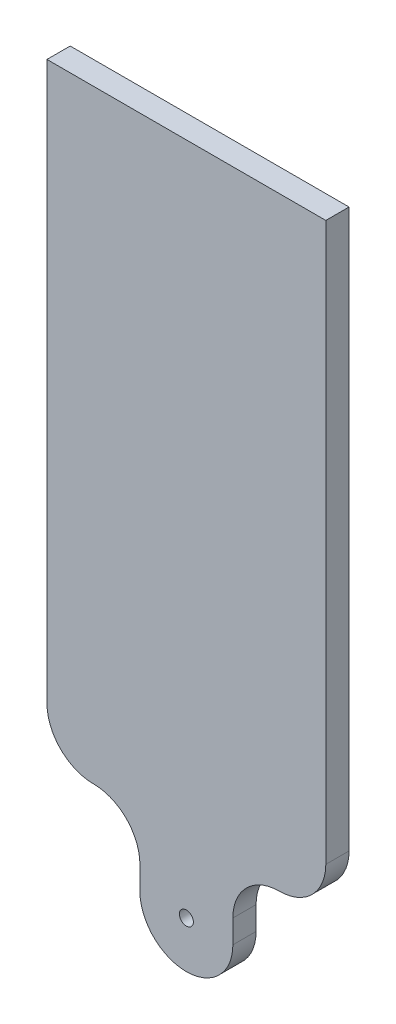
ISO-10303-21;
HEADER;
FILE_DESCRIPTION(('STEP AP214'),'2;1');
FILE_NAME('part.step','',(''),(''),'','','');
FILE_SCHEMA(('AUTOMOTIVE_DESIGN { 1 0 10303 214 1 1 1 1 }'));
ENDSEC;
DATA;
#1=APPLICATION_CONTEXT('core data for automotive mechanical design processes');
#2=APPLICATION_PROTOCOL_DEFINITION('international standard','automotive_design',2000,#1);
#3=PRODUCT_CONTEXT('',#1,'mechanical');
#4=PRODUCT('Part','Part','',(#3));
#5=PRODUCT_RELATED_PRODUCT_CATEGORY('part','',(#4));
#6=PRODUCT_DEFINITION_FORMATION('','',#4);
#7=PRODUCT_DEFINITION_CONTEXT('part definition',#1,'design');
#8=PRODUCT_DEFINITION('design','',#6,#7);
#9=PRODUCT_DEFINITION_SHAPE('','',#8);
#10=(LENGTH_UNIT() NAMED_UNIT(*) SI_UNIT(.MILLI.,.METRE.));
#11=(NAMED_UNIT(*) PLANE_ANGLE_UNIT() SI_UNIT($,.RADIAN.));
#12=(NAMED_UNIT(*) SI_UNIT($,.STERADIAN.) SOLID_ANGLE_UNIT());
#13=UNCERTAINTY_MEASURE_WITH_UNIT(LENGTH_MEASURE(1.E-05),#10,'distance_accuracy_value','');
#14=(GEOMETRIC_REPRESENTATION_CONTEXT(3) GLOBAL_UNCERTAINTY_ASSIGNED_CONTEXT((#13)) GLOBAL_UNIT_ASSIGNED_CONTEXT((#10,
#11,#12)) REPRESENTATION_CONTEXT('',''));
#15=CARTESIAN_POINT('',(0.,0.,0.));
#16=DIRECTION('',(0.,0.,1.));
#17=DIRECTION('',(1.,0.,0.));
#18=AXIS2_PLACEMENT_3D('',#15,#16,#17);
#19=CARTESIAN_POINT('',(-4.08966397750088,13.1353936637728,5.));
#20=DIRECTION('',(0.,0.,-1.));
#21=DIRECTION('',(-1.,0.,0.));
#22=AXIS2_PLACEMENT_3D('',#19,#20,#21);
#23=CYLINDRICAL_SURFACE('',#22,10.);
#24=CARTESIAN_POINT('',(-4.08966397750088,13.1353936637728,0.));
#25=DIRECTION('',(0.,0.,1.));
#26=DIRECTION('',(1.,0.,0.));
#27=AXIS2_PLACEMENT_3D('',#24,#25,#26);
#28=CIRCLE('',#27,10.);
#29=CARTESIAN_POINT('',(-14.0896639775009,13.1353936637728,0.));
#30=VERTEX_POINT('',#29);
#31=CARTESIAN_POINT('',(5.91033602249912,13.1353936637728,0.));
#32=VERTEX_POINT('',#31);
#33=EDGE_CURVE('E130',#30,#32,#28,.T.);
#34=ORIENTED_EDGE('',*,*,#33,.T.);
#35=DIRECTION('',(0.,0.,-1.));
#36=VECTOR('',#35,1.);
#37=CARTESIAN_POINT('',(5.91033602249912,13.1353936637728,5.));
#38=LINE('',#37,#36);
#39=CARTESIAN_POINT('',(5.91033602249912,13.1353936637728,5.));
#40=VERTEX_POINT('',#39);
#41=EDGE_CURVE('E114',#40,#32,#38,.T.);
#42=ORIENTED_EDGE('',*,*,#41,.F.);
#43=CARTESIAN_POINT('',(-4.08966397750088,13.1353936637728,5.));
#44=DIRECTION('',(0.,0.,1.));
#45=DIRECTION('',(1.,0.,0.));
#46=AXIS2_PLACEMENT_3D('',#43,#44,#45);
#47=CIRCLE('',#46,10.);
#48=CARTESIAN_POINT('',(-14.0896639775009,13.1353936637728,5.));
#49=VERTEX_POINT('',#48);
#50=EDGE_CURVE('E119',#49,#40,#47,.T.);
#51=ORIENTED_EDGE('',*,*,#50,.F.);
#52=DIRECTION('',(0.,0.,-1.));
#53=VECTOR('',#52,1.);
#54=CARTESIAN_POINT('',(-14.0896639775009,13.1353936637728,5.));
#55=LINE('',#54,#53);
#56=EDGE_CURVE('E188',#49,#30,#55,.T.);
#57=ORIENTED_EDGE('',*,*,#56,.T.);
#58=EDGE_LOOP('',(#34,#42,#51,#57));
#59=FACE_BOUND('',#58,.T.);
#60=ADVANCED_FACE('F33',(#59),#23,.T.);
#61=CARTESIAN_POINT('',(5.91033602249912,13.1353936637728,5.));
#62=DIRECTION('',(-1.,0.,0.));
#63=DIRECTION('',(0.,0.,1.));
#64=AXIS2_PLACEMENT_3D('',#61,#62,#63);
#65=PLANE('',#64);
#66=DIRECTION('',(0.,1.,0.));
#67=VECTOR('',#66,1.);
#68=CARTESIAN_POINT('',(5.91033602249912,13.1353936637728,0.));
#69=LINE('',#68,#67);
#70=CARTESIAN_POINT('',(5.91033602249912,18.1353936637728,0.));
#71=VERTEX_POINT('',#70);
#72=EDGE_CURVE('E201',#32,#71,#69,.T.);
#73=ORIENTED_EDGE('',*,*,#72,.T.);
#74=DIRECTION('',(0.,0.,-1.));
#75=VECTOR('',#74,1.);
#76=CARTESIAN_POINT('',(5.91033602249912,18.1353936637728,5.));
#77=LINE('',#76,#75);
#78=CARTESIAN_POINT('',(5.91033602249912,18.1353936637728,5.));
#79=VERTEX_POINT('',#78);
#80=EDGE_CURVE('E117',#71,#79,#77,.F.);
#81=ORIENTED_EDGE('',*,*,#80,.T.);
#82=DIRECTION('',(0.,1.,0.));
#83=VECTOR('',#82,1.);
#84=CARTESIAN_POINT('',(5.91033602249912,13.1353936637728,5.));
#85=LINE('',#84,#83);
#86=EDGE_CURVE('E109',#40,#79,#85,.T.);
#87=ORIENTED_EDGE('',*,*,#86,.F.);
#88=ORIENTED_EDGE('',*,*,#41,.T.);
#89=EDGE_LOOP('',(#73,#81,#87,#88));
#90=FACE_BOUND('',#89,.T.);
#91=ADVANCED_FACE('F112',(#90),#65,.F.);
#92=CARTESIAN_POINT('',(25.9103360224991,158.135393663773,5.));
#93=DIRECTION('',(-1.,0.,0.));
#94=DIRECTION('',(0.,-1.,0.));
#95=AXIS2_PLACEMENT_3D('',#92,#93,#94);
#96=PLANE('',#95);
#97=DIRECTION('',(0.,1.,0.));
#98=VECTOR('',#97,1.);
#99=CARTESIAN_POINT('',(25.9103360224991,158.135393663773,5.));
#100=LINE('',#99,#98);
#101=CARTESIAN_POINT('',(25.9103360224991,38.1353936637728,5.));
#102=VERTEX_POINT('',#101);
#103=CARTESIAN_POINT('',(25.9103360224991,158.135393663773,5.));
#104=VERTEX_POINT('',#103);
#105=EDGE_CURVE('E118',#102,#104,#100,.T.);
#106=ORIENTED_EDGE('',*,*,#105,.F.);
#107=DIRECTION('',(0.,0.,-1.));
#108=VECTOR('',#107,1.);
#109=CARTESIAN_POINT('',(25.9103360224991,38.1353936637728,5.));
#110=LINE('',#109,#108);
#111=CARTESIAN_POINT('',(25.9103360224991,38.1353936637728,0.));
#112=VERTEX_POINT('',#111);
#113=EDGE_CURVE('E133',#102,#112,#110,.T.);
#114=ORIENTED_EDGE('',*,*,#113,.T.);
#115=DIRECTION('',(0.,1.,0.));
#116=VECTOR('',#115,1.);
#117=CARTESIAN_POINT('',(25.9103360224991,158.135393663773,0.));
#118=LINE('',#117,#116);
#119=CARTESIAN_POINT('',(25.9103360224991,158.135393663773,0.));
#120=VERTEX_POINT('',#119);
#121=EDGE_CURVE('E199',#112,#120,#118,.T.);
#122=ORIENTED_EDGE('',*,*,#121,.T.);
#123=DIRECTION('',(0.,0.,-1.));
#124=VECTOR('',#123,1.);
#125=CARTESIAN_POINT('',(25.9103360224991,158.135393663773,5.));
#126=LINE('',#125,#124);
#127=EDGE_CURVE('E131',#104,#120,#126,.T.);
#128=ORIENTED_EDGE('',*,*,#127,.F.);
#129=EDGE_LOOP('',(#106,#114,#122,#128));
#130=FACE_BOUND('',#129,.T.);
#131=ADVANCED_FACE('F235',(#130),#96,.F.);
#132=CARTESIAN_POINT('',(-34.0896639775009,158.135393663773,5.));
#133=DIRECTION('',(0.,-1.,0.));
#134=DIRECTION('',(0.,0.,-1.));
#135=AXIS2_PLACEMENT_3D('',#132,#133,#134);
#136=PLANE('',#135);
#137=DIRECTION('',(-1.,0.,0.));
#138=VECTOR('',#137,1.);
#139=CARTESIAN_POINT('',(-34.0896639775009,158.135393663773,0.));
#140=LINE('',#139,#138);
#141=CARTESIAN_POINT('',(-34.0896639775009,158.135393663773,0.));
#142=VERTEX_POINT('',#141);
#143=EDGE_CURVE('E184',#120,#142,#140,.T.);
#144=ORIENTED_EDGE('',*,*,#143,.T.);
#145=DIRECTION('',(0.,0.,-1.));
#146=VECTOR('',#145,1.);
#147=CARTESIAN_POINT('',(-34.0896639775009,158.135393663773,5.));
#148=LINE('',#147,#146);
#149=CARTESIAN_POINT('',(-34.0896639775009,158.135393663773,5.));
#150=VERTEX_POINT('',#149);
#151=EDGE_CURVE('E136',#150,#142,#148,.T.);
#152=ORIENTED_EDGE('',*,*,#151,.F.);
#153=DIRECTION('',(-1.,0.,0.));
#154=VECTOR('',#153,1.);
#155=CARTESIAN_POINT('',(-34.0896639775009,158.135393663773,5.));
#156=LINE('',#155,#154);
#157=EDGE_CURVE('E208',#104,#150,#156,.T.);
#158=ORIENTED_EDGE('',*,*,#157,.F.);
#159=ORIENTED_EDGE('',*,*,#127,.T.);
#160=EDGE_LOOP('',(#144,#152,#158,#159));
#161=FACE_BOUND('',#160,.T.);
#162=ADVANCED_FACE('F287',(#161),#136,.F.);
#163=CARTESIAN_POINT('',(-34.0896639775009,158.135393663773,5.));
#164=DIRECTION('',(1.,0.,0.));
#165=DIRECTION('',(0.,1.,0.));
#166=AXIS2_PLACEMENT_3D('',#163,#164,#165);
#167=PLANE('',#166);
#168=DIRECTION('',(0.,-1.,0.));
#169=VECTOR('',#168,1.);
#170=CARTESIAN_POINT('',(-34.0896639775009,158.135393663773,0.));
#171=LINE('',#170,#169);
#172=CARTESIAN_POINT('',(-34.0896639775009,38.1353936637728,0.));
#173=VERTEX_POINT('',#172);
#174=EDGE_CURVE('E181',#142,#173,#171,.T.);
#175=ORIENTED_EDGE('',*,*,#174,.T.);
#176=DIRECTION('',(0.,0.,-1.));
#177=VECTOR('',#176,1.);
#178=CARTESIAN_POINT('',(-34.0896639775009,38.1353936637728,5.));
#179=LINE('',#178,#177);
#180=CARTESIAN_POINT('',(-34.0896639775009,38.1353936637728,5.));
#181=VERTEX_POINT('',#180);
#182=EDGE_CURVE('E148',#173,#181,#179,.F.);
#183=ORIENTED_EDGE('',*,*,#182,.T.);
#184=DIRECTION('',(0.,-1.,0.));
#185=VECTOR('',#184,1.);
#186=CARTESIAN_POINT('',(-34.0896639775009,158.135393663773,5.));
#187=LINE('',#186,#185);
#188=EDGE_CURVE('E195',#150,#181,#187,.T.);
#189=ORIENTED_EDGE('',*,*,#188,.F.);
#190=ORIENTED_EDGE('',*,*,#151,.T.);
#191=EDGE_LOOP('',(#175,#183,#189,#190));
#192=FACE_BOUND('',#191,.T.);
#193=ADVANCED_FACE('F194',(#192),#167,.F.);
#194=CARTESIAN_POINT('',(-14.0896639775009,13.1353936637728,5.));
#195=DIRECTION('',(1.,0.,0.));
#196=DIRECTION('',(0.,0.,-1.));
#197=AXIS2_PLACEMENT_3D('',#194,#195,#196);
#198=PLANE('',#197);
#199=DIRECTION('',(0.,-1.,0.));
#200=VECTOR('',#199,1.);
#201=CARTESIAN_POINT('',(-14.0896639775009,13.1353936637728,5.));
#202=LINE('',#201,#200);
#203=CARTESIAN_POINT('',(-14.0896639775009,18.1353936637728,5.));
#204=VERTEX_POINT('',#203);
#205=EDGE_CURVE('E123',#204,#49,#202,.T.);
#206=ORIENTED_EDGE('',*,*,#205,.F.);
#207=DIRECTION('',(0.,0.,-1.));
#208=VECTOR('',#207,1.);
#209=CARTESIAN_POINT('',(-14.0896639775009,18.1353936637728,0.));
#210=LINE('',#209,#208);
#211=CARTESIAN_POINT('',(-14.0896639775009,18.1353936637728,0.));
#212=VERTEX_POINT('',#211);
#213=EDGE_CURVE('E151',#204,#212,#210,.T.);
#214=ORIENTED_EDGE('',*,*,#213,.T.);
#215=DIRECTION('',(0.,-1.,0.));
#216=VECTOR('',#215,1.);
#217=CARTESIAN_POINT('',(-14.0896639775009,13.1353936637728,0.));
#218=LINE('',#217,#216);
#219=EDGE_CURVE('E127',#212,#30,#218,.T.);
#220=ORIENTED_EDGE('',*,*,#219,.T.);
#221=ORIENTED_EDGE('',*,*,#56,.F.);
#222=EDGE_LOOP('',(#206,#214,#220,#221));
#223=FACE_BOUND('',#222,.T.);
#224=ADVANCED_FACE('F177',(#223),#198,.F.);
#225=CARTESIAN_POINT('',(-4.08966397750088,13.1353936637728,5.));
#226=DIRECTION('',(0.,0.,1.));
#227=DIRECTION('',(1.,0.,0.));
#228=AXIS2_PLACEMENT_3D('',#225,#226,#227);
#229=PLANE('',#228);
#230=CARTESIAN_POINT('',(-4.08966397750088,13.1353936637728,5.));
#231=DIRECTION('',(0.,0.,1.));
#232=DIRECTION('',(1.,0.,0.));
#233=AXIS2_PLACEMENT_3D('',#230,#231,#232);
#234=CIRCLE('',#233,1.5);
#235=CARTESIAN_POINT('',(-2.58966397750088,13.1353936637728,5.));
#236=VERTEX_POINT('',#235);
#237=EDGE_CURVE('E159',#236,#236,#234,.T.);
#238=ORIENTED_EDGE('',*,*,#237,.F.);
#239=EDGE_LOOP('',(#238));
#240=FACE_BOUND('',#239,.T.);
#241=ORIENTED_EDGE('',*,*,#86,.T.);
#242=CARTESIAN_POINT('',(15.9103360224991,18.1353936637728,5.));
#243=DIRECTION('',(0.,0.,1.));
#244=DIRECTION('',(1.,0.,0.));
#245=AXIS2_PLACEMENT_3D('',#242,#243,#244);
#246=CIRCLE('',#245,10.);
#247=CARTESIAN_POINT('',(15.9103360224991,28.1353936637728,5.));
#248=VERTEX_POINT('',#247);
#249=EDGE_CURVE('E155',#79,#248,#246,.F.);
#250=ORIENTED_EDGE('',*,*,#249,.T.);
#251=CARTESIAN_POINT('',(15.9103360224991,38.1353936637728,5.));
#252=DIRECTION('',(0.,0.,1.));
#253=DIRECTION('',(1.,0.,0.));
#254=AXIS2_PLACEMENT_3D('',#251,#252,#253);
#255=CIRCLE('',#254,10.);
#256=EDGE_CURVE('E146',#248,#102,#255,.T.);
#257=ORIENTED_EDGE('',*,*,#256,.T.);
#258=ORIENTED_EDGE('',*,*,#105,.T.);
#259=ORIENTED_EDGE('',*,*,#157,.T.);
#260=ORIENTED_EDGE('',*,*,#188,.T.);
#261=CARTESIAN_POINT('',(-24.0896639775009,38.1353936637728,5.));
#262=DIRECTION('',(0.,0.,1.));
#263=DIRECTION('',(1.,0.,0.));
#264=AXIS2_PLACEMENT_3D('',#261,#262,#263);
#265=CIRCLE('',#264,10.);
#266=CARTESIAN_POINT('',(-24.0896639775009,28.1353936637728,5.));
#267=VERTEX_POINT('',#266);
#268=EDGE_CURVE('E53',#181,#267,#265,.T.);
#269=ORIENTED_EDGE('',*,*,#268,.T.);
#270=CARTESIAN_POINT('',(-24.0896639775009,18.1353936637728,5.));
#271=DIRECTION('',(0.,0.,1.));
#272=DIRECTION('',(1.,0.,0.));
#273=AXIS2_PLACEMENT_3D('',#270,#271,#272);
#274=CIRCLE('',#273,10.);
#275=EDGE_CURVE('E11',#267,#204,#274,.F.);
#276=ORIENTED_EDGE('',*,*,#275,.T.);
#277=ORIENTED_EDGE('',*,*,#205,.T.);
#278=ORIENTED_EDGE('',*,*,#50,.T.);
#279=EDGE_LOOP('',(#241,#250,#257,#258,#259,#260,#269,#276,#277,#278));
#280=FACE_BOUND('',#279,.T.);
#281=ADVANCED_FACE('F122',(#240,#280),#229,.T.);
#282=CARTESIAN_POINT('',(-4.08966397750088,13.1353936637728,0.));
#283=DIRECTION('',(0.,0.,1.));
#284=DIRECTION('',(1.,0.,0.));
#285=AXIS2_PLACEMENT_3D('',#282,#283,#284);
#286=PLANE('',#285);
#287=CARTESIAN_POINT('',(-4.08966397750088,13.1353936637728,0.));
#288=DIRECTION('',(0.,0.,1.));
#289=DIRECTION('',(1.,0.,0.));
#290=AXIS2_PLACEMENT_3D('',#287,#288,#289);
#291=CIRCLE('',#290,1.5);
#292=CARTESIAN_POINT('',(-2.58966397750088,13.1353936637728,0.));
#293=VERTEX_POINT('',#292);
#294=EDGE_CURVE('E164',#293,#293,#291,.T.);
#295=ORIENTED_EDGE('',*,*,#294,.T.);
#296=EDGE_LOOP('',(#295));
#297=FACE_BOUND('',#296,.T.);
#298=ORIENTED_EDGE('',*,*,#121,.F.);
#299=CARTESIAN_POINT('',(15.9103360224991,38.1353936637728,0.));
#300=DIRECTION('',(0.,0.,1.));
#301=DIRECTION('',(1.,0.,0.));
#302=AXIS2_PLACEMENT_3D('',#299,#300,#301);
#303=CIRCLE('',#302,10.);
#304=CARTESIAN_POINT('',(15.9103360224991,28.1353936637728,0.));
#305=VERTEX_POINT('',#304);
#306=EDGE_CURVE('E143',#112,#305,#303,.F.);
#307=ORIENTED_EDGE('',*,*,#306,.T.);
#308=CARTESIAN_POINT('',(15.9103360224991,18.1353936637728,0.));
#309=DIRECTION('',(0.,0.,1.));
#310=DIRECTION('',(1.,0.,0.));
#311=AXIS2_PLACEMENT_3D('',#308,#309,#310);
#312=CIRCLE('',#311,10.);
#313=EDGE_CURVE('E153',#305,#71,#312,.T.);
#314=ORIENTED_EDGE('',*,*,#313,.T.);
#315=ORIENTED_EDGE('',*,*,#72,.F.);
#316=ORIENTED_EDGE('',*,*,#33,.F.);
#317=ORIENTED_EDGE('',*,*,#219,.F.);
#318=CARTESIAN_POINT('',(-24.0896639775009,18.1353936637728,0.));
#319=DIRECTION('',(0.,0.,1.));
#320=DIRECTION('',(1.,0.,0.));
#321=AXIS2_PLACEMENT_3D('',#318,#319,#320);
#322=CIRCLE('',#321,10.);
#323=CARTESIAN_POINT('',(-24.0896639775009,28.1353936637728,0.));
#324=VERTEX_POINT('',#323);
#325=EDGE_CURVE('E42',#212,#324,#322,.T.);
#326=ORIENTED_EDGE('',*,*,#325,.T.);
#327=CARTESIAN_POINT('',(-24.0896639775009,38.1353936637728,0.));
#328=DIRECTION('',(0.,0.,1.));
#329=DIRECTION('',(1.,0.,0.));
#330=AXIS2_PLACEMENT_3D('',#327,#328,#329);
#331=CIRCLE('',#330,10.);
#332=EDGE_CURVE('E141',#324,#173,#331,.F.);
#333=ORIENTED_EDGE('',*,*,#332,.T.);
#334=ORIENTED_EDGE('',*,*,#174,.F.);
#335=ORIENTED_EDGE('',*,*,#143,.F.);
#336=EDGE_LOOP('',(#298,#307,#314,#315,#316,#317,#326,#333,#334,#335));
#337=FACE_BOUND('',#336,.T.);
#338=ADVANCED_FACE('F180',(#297,#337),#286,.F.);
#339=CARTESIAN_POINT('',(-4.08966397750088,13.1353936637728,0.));
#340=DIRECTION('',(0.,0.,1.));
#341=DIRECTION('',(1.,0.,0.));
#342=AXIS2_PLACEMENT_3D('',#339,#340,#341);
#343=CYLINDRICAL_SURFACE('',#342,1.5);
#344=ORIENTED_EDGE('',*,*,#294,.F.);
#345=EDGE_LOOP('',(#344));
#346=FACE_BOUND('',#345,.T.);
#347=ORIENTED_EDGE('',*,*,#237,.T.);
#348=EDGE_LOOP('',(#347));
#349=FACE_BOUND('',#348,.T.);
#350=ADVANCED_FACE('F215',(#346,#349),#343,.F.);
#351=CARTESIAN_POINT('',(15.9103360224991,38.1353936637728,5.));
#352=DIRECTION('',(0.,0.,-1.));
#353=DIRECTION('',(-1.,0.,0.));
#354=AXIS2_PLACEMENT_3D('',#351,#352,#353);
#355=CYLINDRICAL_SURFACE('',#354,10.);
#356=ORIENTED_EDGE('',*,*,#113,.F.);
#357=ORIENTED_EDGE('',*,*,#256,.F.);
#358=DIRECTION('',(0.,0.,-1.));
#359=VECTOR('',#358,1.);
#360=CARTESIAN_POINT('',(15.9103360224991,28.1353936637728,5.));
#361=LINE('',#360,#359);
#362=EDGE_CURVE('E157',#305,#248,#361,.F.);
#363=ORIENTED_EDGE('',*,*,#362,.F.);
#364=ORIENTED_EDGE('',*,*,#306,.F.);
#365=EDGE_LOOP('',(#356,#357,#363,#364));
#366=FACE_BOUND('',#365,.T.);
#367=ADVANCED_FACE('F218',(#366),#355,.T.);
#368=CARTESIAN_POINT('',(15.9103360224991,18.1353936637728,5.));
#369=DIRECTION('',(0.,0.,1.));
#370=DIRECTION('',(1.,0.,0.));
#371=AXIS2_PLACEMENT_3D('',#368,#369,#370);
#372=CYLINDRICAL_SURFACE('',#371,10.);
#373=ORIENTED_EDGE('',*,*,#249,.F.);
#374=ORIENTED_EDGE('',*,*,#80,.F.);
#375=ORIENTED_EDGE('',*,*,#313,.F.);
#376=ORIENTED_EDGE('',*,*,#362,.T.);
#377=EDGE_LOOP('',(#373,#374,#375,#376));
#378=FACE_BOUND('',#377,.T.);
#379=ADVANCED_FACE('F239',(#378),#372,.F.);
#380=CARTESIAN_POINT('',(-24.0896639775009,18.1353936637728,5.));
#381=DIRECTION('',(0.,0.,1.));
#382=DIRECTION('',(1.,0.,0.));
#383=AXIS2_PLACEMENT_3D('',#380,#381,#382);
#384=CYLINDRICAL_SURFACE('',#383,10.);
#385=ORIENTED_EDGE('',*,*,#213,.F.);
#386=ORIENTED_EDGE('',*,*,#275,.F.);
#387=DIRECTION('',(0.,0.,-1.));
#388=VECTOR('',#387,1.);
#389=CARTESIAN_POINT('',(-24.0896639775009,28.1353936637728,5.));
#390=LINE('',#389,#388);
#391=EDGE_CURVE('E37',#324,#267,#390,.F.);
#392=ORIENTED_EDGE('',*,*,#391,.F.);
#393=ORIENTED_EDGE('',*,*,#325,.F.);
#394=EDGE_LOOP('',(#385,#386,#392,#393));
#395=FACE_BOUND('',#394,.T.);
#396=ADVANCED_FACE('F35',(#395),#384,.F.);
#397=CARTESIAN_POINT('',(-24.0896639775009,38.1353936637728,5.));
#398=DIRECTION('',(0.,0.,-1.));
#399=DIRECTION('',(-1.,0.,0.));
#400=AXIS2_PLACEMENT_3D('',#397,#398,#399);
#401=CYLINDRICAL_SURFACE('',#400,10.);
#402=ORIENTED_EDGE('',*,*,#268,.F.);
#403=ORIENTED_EDGE('',*,*,#182,.F.);
#404=ORIENTED_EDGE('',*,*,#332,.F.);
#405=ORIENTED_EDGE('',*,*,#391,.T.);
#406=EDGE_LOOP('',(#402,#403,#404,#405));
#407=FACE_BOUND('',#406,.T.);
#408=ADVANCED_FACE('F170',(#407),#401,.T.);
#409=CLOSED_SHELL('',(#60,#91,#131,#162,#193,#224,#281,#338,#350,#367,#379,#396,#408));
#410=MANIFOLD_SOLID_BREP('B2',#409);
#411=ADVANCED_BREP_SHAPE_REPRESENTATION('',(#18,#410),#14);
#412=SHAPE_DEFINITION_REPRESENTATION(#9,#411);
ENDSEC;
END-ISO-10303-21;
